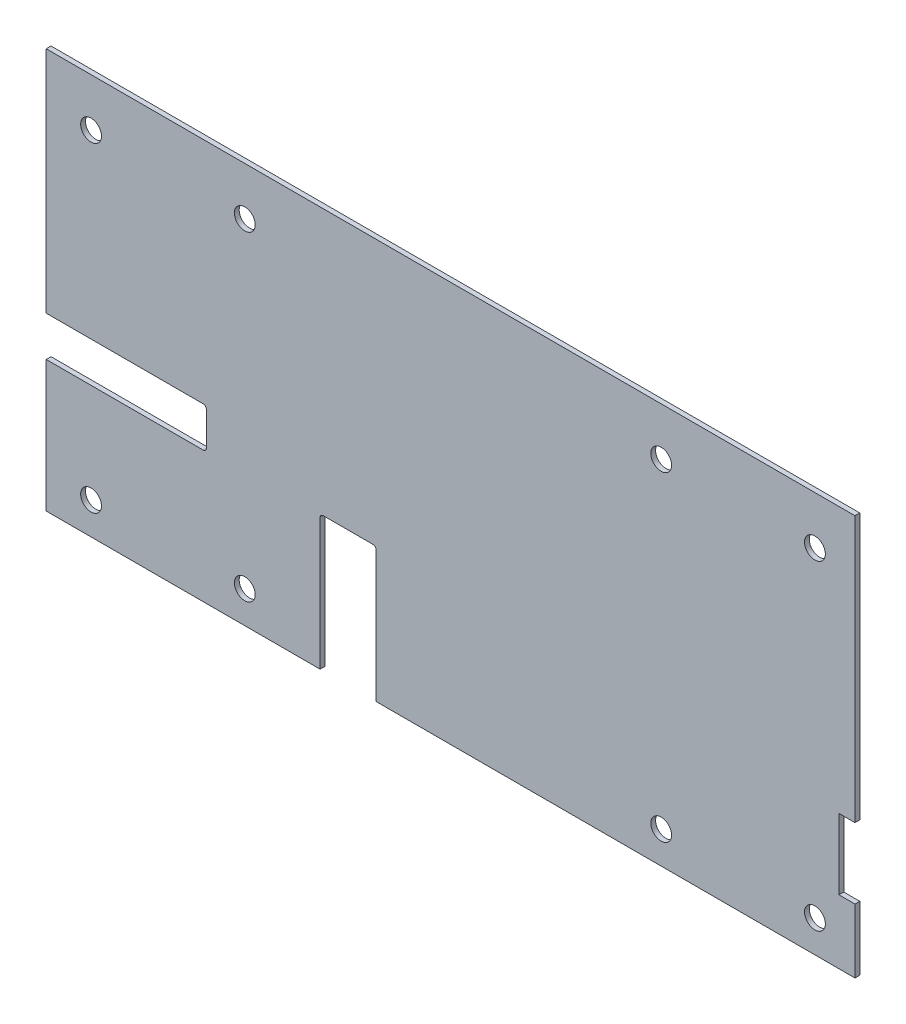
ISO-10303-21;
HEADER;
FILE_DESCRIPTION(('STEP AP214'),'2;1');
FILE_NAME('part.step','',(''),(''),'','','');
FILE_SCHEMA(('AUTOMOTIVE_DESIGN { 1 0 10303 214 1 1 1 1 }'));
ENDSEC;
DATA;
#1=APPLICATION_CONTEXT('core data for automotive mechanical design processes');
#2=APPLICATION_PROTOCOL_DEFINITION('international standard','automotive_design',2000,#1);
#3=PRODUCT_CONTEXT('',#1,'mechanical');
#4=PRODUCT('Part','Part','',(#3));
#5=PRODUCT_RELATED_PRODUCT_CATEGORY('part','',(#4));
#6=PRODUCT_DEFINITION_FORMATION('','',#4);
#7=PRODUCT_DEFINITION_CONTEXT('part definition',#1,'design');
#8=PRODUCT_DEFINITION('design','',#6,#7);
#9=PRODUCT_DEFINITION_SHAPE('','',#8);
#10=(LENGTH_UNIT() NAMED_UNIT(*) SI_UNIT(.MILLI.,.METRE.));
#11=(NAMED_UNIT(*) PLANE_ANGLE_UNIT() SI_UNIT($,.RADIAN.));
#12=(NAMED_UNIT(*) SI_UNIT($,.STERADIAN.) SOLID_ANGLE_UNIT());
#13=UNCERTAINTY_MEASURE_WITH_UNIT(LENGTH_MEASURE(1.E-05),#10,'distance_accuracy_value','');
#14=(GEOMETRIC_REPRESENTATION_CONTEXT(3) GLOBAL_UNCERTAINTY_ASSIGNED_CONTEXT((#13)) GLOBAL_UNIT_ASSIGNED_CONTEXT((#10,
#11,#12)) REPRESENTATION_CONTEXT('',''));
#15=CARTESIAN_POINT('',(0.,0.,0.));
#16=DIRECTION('',(0.,0.,1.));
#17=DIRECTION('',(1.,0.,0.));
#18=AXIS2_PLACEMENT_3D('',#15,#16,#17);
#19=CARTESIAN_POINT('',(-252.5,-125.,3.));
#20=DIRECTION('',(1.,0.,0.));
#21=DIRECTION('',(0.,0.,-1.));
#22=AXIS2_PLACEMENT_3D('',#19,#20,#21);
#23=PLANE('',#22);
#24=DIRECTION('',(0.,-1.,0.));
#25=VECTOR('',#24,1.);
#26=CARTESIAN_POINT('',(-252.5,-125.,0.));
#27=LINE('',#26,#25);
#28=CARTESIAN_POINT('',(-252.5,125.,0.));
#29=VERTEX_POINT('',#28);
#30=CARTESIAN_POINT('',(-252.5,-17.99999999999,0.));
#31=VERTEX_POINT('',#30);
#32=EDGE_CURVE('E218',#29,#31,#27,.T.);
#33=ORIENTED_EDGE('',*,*,#32,.T.);
#34=DIRECTION('',(0.,0.,1.));
#35=VECTOR('',#34,1.);
#36=CARTESIAN_POINT('',(-252.5,-17.99999999999,3.));
#37=LINE('',#36,#35);
#38=CARTESIAN_POINT('',(-252.5,-17.99999999999,3.));
#39=VERTEX_POINT('',#38);
#40=EDGE_CURVE('E179',#31,#39,#37,.T.);
#41=ORIENTED_EDGE('',*,*,#40,.T.);
#42=DIRECTION('',(0.,-1.,0.));
#43=VECTOR('',#42,1.);
#44=CARTESIAN_POINT('',(-252.5,-125.,3.));
#45=LINE('',#44,#43);
#46=CARTESIAN_POINT('',(-252.5,125.,3.));
#47=VERTEX_POINT('',#46);
#48=EDGE_CURVE('E198',#47,#39,#45,.T.);
#49=ORIENTED_EDGE('',*,*,#48,.F.);
#50=DIRECTION('',(0.,0.,-1.));
#51=VECTOR('',#50,1.);
#52=CARTESIAN_POINT('',(-252.5,125.,3.));
#53=LINE('',#52,#51);
#54=EDGE_CURVE('E217',#47,#29,#53,.T.);
#55=ORIENTED_EDGE('',*,*,#54,.T.);
#56=EDGE_LOOP('',(#33,#41,#49,#55));
#57=FACE_BOUND('',#56,.T.);
#58=ADVANCED_FACE('F33',(#57),#23,.F.);
#59=CARTESIAN_POINT('',(252.5,-125.,3.));
#60=DIRECTION('',(0.,1.,0.));
#61=DIRECTION('',(-1.,0.,0.));
#62=AXIS2_PLACEMENT_3D('',#59,#60,#61);
#63=PLANE('',#62);
#64=DIRECTION('',(1.,0.,0.));
#65=VECTOR('',#64,1.);
#66=CARTESIAN_POINT('',(252.5,-125.,3.));
#67=LINE('',#66,#65);
#68=CARTESIAN_POINT('',(-46.5,-125.,3.));
#69=VERTEX_POINT('',#68);
#70=CARTESIAN_POINT('',(252.5,-125.,3.));
#71=VERTEX_POINT('',#70);
#72=EDGE_CURVE('E202',#69,#71,#67,.T.);
#73=ORIENTED_EDGE('',*,*,#72,.F.);
#74=DIRECTION('',(0.,0.,-1.));
#75=VECTOR('',#74,1.);
#76=CARTESIAN_POINT('',(-46.5,-125.,3.));
#77=LINE('',#76,#75);
#78=CARTESIAN_POINT('',(-46.5,-125.,0.));
#79=VERTEX_POINT('',#78);
#80=EDGE_CURVE('E180',#69,#79,#77,.T.);
#81=ORIENTED_EDGE('',*,*,#80,.T.);
#82=DIRECTION('',(1.,0.,0.));
#83=VECTOR('',#82,1.);
#84=CARTESIAN_POINT('',(252.5,-125.,0.));
#85=LINE('',#84,#83);
#86=CARTESIAN_POINT('',(252.5,-125.,0.));
#87=VERTEX_POINT('',#86);
#88=EDGE_CURVE('E221',#79,#87,#85,.T.);
#89=ORIENTED_EDGE('',*,*,#88,.T.);
#90=DIRECTION('',(0.,0.,-1.));
#91=VECTOR('',#90,1.);
#92=CARTESIAN_POINT('',(252.5,-125.,3.));
#93=LINE('',#92,#91);
#94=EDGE_CURVE('E234',#71,#87,#93,.T.);
#95=ORIENTED_EDGE('',*,*,#94,.F.);
#96=EDGE_LOOP('',(#73,#81,#89,#95));
#97=FACE_BOUND('',#96,.T.);
#98=ADVANCED_FACE('F373',(#97),#63,.F.);
#99=CARTESIAN_POINT('',(252.5,-125.,3.));
#100=DIRECTION('',(-1.,0.,0.));
#101=DIRECTION('',(0.,0.,1.));
#102=AXIS2_PLACEMENT_3D('',#99,#100,#101);
#103=PLANE('',#102);
#104=DIRECTION('',(0.,1.,0.));
#105=VECTOR('',#104,1.);
#106=CARTESIAN_POINT('',(252.5,-125.,0.));
#107=LINE('',#106,#105);
#108=CARTESIAN_POINT('',(252.5,-84.9999999999899,0.));
#109=VERTEX_POINT('',#108);
#110=EDGE_CURVE('E203',#87,#109,#107,.T.);
#111=ORIENTED_EDGE('',*,*,#110,.T.);
#112=DIRECTION('',(0.,0.,1.));
#113=VECTOR('',#112,1.);
#114=CARTESIAN_POINT('',(252.5,-84.9999999999899,3.));
#115=LINE('',#114,#113);
#116=CARTESIAN_POINT('',(252.5,-84.9999999999899,3.));
#117=VERTEX_POINT('',#116);
#118=EDGE_CURVE('E241',#109,#117,#115,.T.);
#119=ORIENTED_EDGE('',*,*,#118,.T.);
#120=DIRECTION('',(0.,1.,0.));
#121=VECTOR('',#120,1.);
#122=CARTESIAN_POINT('',(252.5,-125.,3.));
#123=LINE('',#122,#121);
#124=EDGE_CURVE('E212',#71,#117,#123,.T.);
#125=ORIENTED_EDGE('',*,*,#124,.F.);
#126=ORIENTED_EDGE('',*,*,#94,.T.);
#127=EDGE_LOOP('',(#111,#119,#125,#126));
#128=FACE_BOUND('',#127,.T.);
#129=ADVANCED_FACE('F379',(#128),#103,.F.);
#130=CARTESIAN_POINT('',(0.,0.,3.));
#131=DIRECTION('',(0.,0.,1.));
#132=DIRECTION('',(1.,0.,0.));
#133=AXIS2_PLACEMENT_3D('',#130,#131,#132);
#134=PLANE('',#133);
#135=DIRECTION('',(-1.,0.,0.));
#136=VECTOR('',#135,1.);
#137=CARTESIAN_POINT('',(-252.5,-17.99999999999,3.));
#138=LINE('',#137,#136);
#139=CARTESIAN_POINT('',(-154.5,-17.99999999999,3.));
#140=VERTEX_POINT('',#139);
#141=EDGE_CURVE('E289',#140,#39,#138,.T.);
#142=ORIENTED_EDGE('',*,*,#141,.F.);
#143=CARTESIAN_POINT('',(-154.5,-19.99999999999,3.));
#144=DIRECTION('',(0.,0.,1.));
#145=DIRECTION('',(1.,0.,0.));
#146=AXIS2_PLACEMENT_3D('',#143,#144,#145);
#147=CIRCLE('',#146,2.);
#148=CARTESIAN_POINT('',(-152.5,-19.99999999999,3.));
#149=VERTEX_POINT('',#148);
#150=EDGE_CURVE('E41',#140,#149,#147,.F.);
#151=ORIENTED_EDGE('',*,*,#150,.T.);
#152=DIRECTION('',(0.,1.,0.));
#153=VECTOR('',#152,1.);
#154=CARTESIAN_POINT('',(-152.5,-42.99999999999,3.));
#155=LINE('',#154,#153);
#156=CARTESIAN_POINT('',(-152.5,-40.99999999999,3.));
#157=VERTEX_POINT('',#156);
#158=EDGE_CURVE('E191',#157,#149,#155,.T.);
#159=ORIENTED_EDGE('',*,*,#158,.F.);
#160=CARTESIAN_POINT('',(-154.5,-40.99999999999,3.));
#161=DIRECTION('',(0.,0.,1.));
#162=DIRECTION('',(1.,0.,0.));
#163=AXIS2_PLACEMENT_3D('',#160,#161,#162);
#164=CIRCLE('',#163,2.);
#165=CARTESIAN_POINT('',(-154.5,-42.99999999999,3.));
#166=VERTEX_POINT('',#165);
#167=EDGE_CURVE('E190',#157,#166,#164,.F.);
#168=ORIENTED_EDGE('',*,*,#167,.T.);
#169=DIRECTION('',(1.,0.,0.));
#170=VECTOR('',#169,1.);
#171=CARTESIAN_POINT('',(-252.5,-42.99999999999,3.));
#172=LINE('',#171,#170);
#173=CARTESIAN_POINT('',(-252.5,-42.99999999999,3.));
#174=VERTEX_POINT('',#173);
#175=EDGE_CURVE('E172',#174,#166,#172,.T.);
#176=ORIENTED_EDGE('',*,*,#175,.F.);
#177=CARTESIAN_POINT('',(-252.5,-125.,3.));
#178=VERTEX_POINT('',#177);
#179=EDGE_CURVE('E187',#174,#178,#45,.T.);
#180=ORIENTED_EDGE('',*,*,#179,.T.);
#181=CARTESIAN_POINT('',(-81.5000000000001,-125.,3.));
#182=VERTEX_POINT('',#181);
#183=EDGE_CURVE('E209',#178,#182,#67,.T.);
#184=ORIENTED_EDGE('',*,*,#183,.T.);
#185=DIRECTION('',(0.,-1.,0.));
#186=VECTOR('',#185,1.);
#187=CARTESIAN_POINT('',(-81.5,-40.99999999999,3.));
#188=LINE('',#187,#186);
#189=CARTESIAN_POINT('',(-81.5,-42.99999999999,3.));
#190=VERTEX_POINT('',#189);
#191=EDGE_CURVE('E192',#190,#182,#188,.T.);
#192=ORIENTED_EDGE('',*,*,#191,.F.);
#193=CARTESIAN_POINT('',(-79.5,-42.99999999999,3.));
#194=DIRECTION('',(0.,0.,1.));
#195=DIRECTION('',(1.,0.,0.));
#196=AXIS2_PLACEMENT_3D('',#193,#194,#195);
#197=CIRCLE('',#196,2.);
#198=CARTESIAN_POINT('',(-79.5,-40.99999999999,3.));
#199=VERTEX_POINT('',#198);
#200=EDGE_CURVE('E282',#190,#199,#197,.F.);
#201=ORIENTED_EDGE('',*,*,#200,.T.);
#202=DIRECTION('',(-1.,0.,0.));
#203=VECTOR('',#202,1.);
#204=CARTESIAN_POINT('',(-46.5,-40.99999999999,3.));
#205=LINE('',#204,#203);
#206=CARTESIAN_POINT('',(-48.5,-40.99999999999,3.));
#207=VERTEX_POINT('',#206);
#208=EDGE_CURVE('E431',#207,#199,#205,.T.);
#209=ORIENTED_EDGE('',*,*,#208,.F.);
#210=CARTESIAN_POINT('',(-48.5,-42.99999999999,3.));
#211=DIRECTION('',(0.,0.,1.));
#212=DIRECTION('',(1.,0.,0.));
#213=AXIS2_PLACEMENT_3D('',#210,#211,#212);
#214=CIRCLE('',#213,2.);
#215=CARTESIAN_POINT('',(-46.5,-42.99999999999,3.));
#216=VERTEX_POINT('',#215);
#217=EDGE_CURVE('E278',#207,#216,#214,.F.);
#218=ORIENTED_EDGE('',*,*,#217,.T.);
#219=DIRECTION('',(0.,1.,0.));
#220=VECTOR('',#219,1.);
#221=CARTESIAN_POINT('',(-46.5,-40.99999999999,3.));
#222=LINE('',#221,#220);
#223=EDGE_CURVE('E436',#69,#216,#222,.T.);
#224=ORIENTED_EDGE('',*,*,#223,.F.);
#225=ORIENTED_EDGE('',*,*,#72,.T.);
#226=ORIENTED_EDGE('',*,*,#124,.T.);
#227=DIRECTION('',(1.,0.,0.));
#228=VECTOR('',#227,1.);
#229=CARTESIAN_POINT('',(252.5,-84.9999999999899,3.));
#230=LINE('',#229,#228);
#231=CARTESIAN_POINT('',(242.5,-84.9999999999899,3.));
#232=VERTEX_POINT('',#231);
#233=EDGE_CURVE('E449',#232,#117,#230,.T.);
#234=ORIENTED_EDGE('',*,*,#233,.F.);
#235=DIRECTION('',(0.,-1.,0.));
#236=VECTOR('',#235,1.);
#237=CARTESIAN_POINT('',(242.5,-40.9999999999899,3.));
#238=LINE('',#237,#236);
#239=CARTESIAN_POINT('',(242.5,-40.9999999999899,3.));
#240=VERTEX_POINT('',#239);
#241=EDGE_CURVE('E446',#240,#232,#238,.T.);
#242=ORIENTED_EDGE('',*,*,#241,.F.);
#243=DIRECTION('',(-1.,0.,0.));
#244=VECTOR('',#243,1.);
#245=CARTESIAN_POINT('',(252.5,-40.9999999999899,3.));
#246=LINE('',#245,#244);
#247=CARTESIAN_POINT('',(252.5,-40.9999999999899,3.));
#248=VERTEX_POINT('',#247);
#249=EDGE_CURVE('E443',#248,#240,#246,.T.);
#250=ORIENTED_EDGE('',*,*,#249,.F.);
#251=CARTESIAN_POINT('',(252.5,125.,3.));
#252=VERTEX_POINT('',#251);
#253=EDGE_CURVE('E211',#248,#252,#123,.T.);
#254=ORIENTED_EDGE('',*,*,#253,.T.);
#255=DIRECTION('',(-1.,0.,0.));
#256=VECTOR('',#255,1.);
#257=CARTESIAN_POINT('',(252.5,125.,3.));
#258=LINE('',#257,#256);
#259=EDGE_CURVE('E215',#252,#47,#258,.T.);
#260=ORIENTED_EDGE('',*,*,#259,.T.);
#261=ORIENTED_EDGE('',*,*,#48,.T.);
#262=EDGE_LOOP('',(#142,#151,#159,#168,#176,#180,#184,#192,#201,#209,#218,#224,#225,#226,#234,
#242,#250,#254,#260,#261));
#263=FACE_BOUND('',#262,.T.);
#264=CARTESIAN_POINT('',(-224.5,95.0000000000001,3.));
#265=DIRECTION('',(0.,0.,1.));
#266=DIRECTION('',(1.,0.,0.));
#267=AXIS2_PLACEMENT_3D('',#264,#265,#266);
#268=CIRCLE('',#267,6.50000000000002);
#269=CARTESIAN_POINT('',(-218.,95.0000000000001,3.));
#270=VERTEX_POINT('',#269);
#271=EDGE_CURVE('E312',#270,#270,#268,.T.);
#272=ORIENTED_EDGE('',*,*,#271,.F.);
#273=EDGE_LOOP('',(#272));
#274=FACE_BOUND('',#273,.T.);
#275=CARTESIAN_POINT('',(-128.5,-105.,3.));
#276=DIRECTION('',(0.,0.,1.));
#277=DIRECTION('',(1.,0.,0.));
#278=AXIS2_PLACEMENT_3D('',#275,#276,#277);
#279=CIRCLE('',#278,6.50000000000002);
#280=CARTESIAN_POINT('',(-122.,-105.,3.));
#281=VERTEX_POINT('',#280);
#282=EDGE_CURVE('E324',#281,#281,#279,.T.);
#283=ORIENTED_EDGE('',*,*,#282,.F.);
#284=EDGE_LOOP('',(#283));
#285=FACE_BOUND('',#284,.T.);
#286=CARTESIAN_POINT('',(131.5,-105.,3.));
#287=DIRECTION('',(0.,0.,1.));
#288=DIRECTION('',(1.,0.,0.));
#289=AXIS2_PLACEMENT_3D('',#286,#287,#288);
#290=CIRCLE('',#289,6.50000000000002);
#291=CARTESIAN_POINT('',(138.,-105.,3.));
#292=VERTEX_POINT('',#291);
#293=EDGE_CURVE('E336',#292,#292,#290,.T.);
#294=ORIENTED_EDGE('',*,*,#293,.F.);
#295=EDGE_LOOP('',(#294));
#296=FACE_BOUND('',#295,.T.);
#297=CARTESIAN_POINT('',(131.5,95.0000000000001,3.));
#298=DIRECTION('',(0.,0.,1.));
#299=DIRECTION('',(1.,0.,0.));
#300=AXIS2_PLACEMENT_3D('',#297,#298,#299);
#301=CIRCLE('',#300,6.50000000000002);
#302=CARTESIAN_POINT('',(138.,95.0000000000001,3.));
#303=VERTEX_POINT('',#302);
#304=EDGE_CURVE('E346',#303,#303,#301,.T.);
#305=ORIENTED_EDGE('',*,*,#304,.F.);
#306=EDGE_LOOP('',(#305));
#307=FACE_BOUND('',#306,.T.);
#308=CARTESIAN_POINT('',(227.5,95.0000000000001,3.));
#309=DIRECTION('',(0.,0.,1.));
#310=DIRECTION('',(1.,0.,0.));
#311=AXIS2_PLACEMENT_3D('',#308,#309,#310);
#312=CIRCLE('',#311,6.50000000000002);
#313=CARTESIAN_POINT('',(234.,95.0000000000001,3.));
#314=VERTEX_POINT('',#313);
#315=EDGE_CURVE('E342',#314,#314,#312,.T.);
#316=ORIENTED_EDGE('',*,*,#315,.F.);
#317=EDGE_LOOP('',(#316));
#318=FACE_BOUND('',#317,.T.);
#319=CARTESIAN_POINT('',(227.5,-105.,3.));
#320=DIRECTION('',(0.,0.,1.));
#321=DIRECTION('',(1.,0.,0.));
#322=AXIS2_PLACEMENT_3D('',#319,#320,#321);
#323=CIRCLE('',#322,6.50000000000007);
#324=CARTESIAN_POINT('',(234.,-105.,3.));
#325=VERTEX_POINT('',#324);
#326=EDGE_CURVE('E330',#325,#325,#323,.T.);
#327=ORIENTED_EDGE('',*,*,#326,.F.);
#328=EDGE_LOOP('',(#327));
#329=FACE_BOUND('',#328,.T.);
#330=CARTESIAN_POINT('',(-128.5,95.0000000000001,3.));
#331=DIRECTION('',(0.,0.,1.));
#332=DIRECTION('',(1.,0.,0.));
#333=AXIS2_PLACEMENT_3D('',#330,#331,#332);
#334=CIRCLE('',#333,6.50000000000002);
#335=CARTESIAN_POINT('',(-122.,95.0000000000001,3.));
#336=VERTEX_POINT('',#335);
#337=EDGE_CURVE('E318',#336,#336,#334,.T.);
#338=ORIENTED_EDGE('',*,*,#337,.F.);
#339=EDGE_LOOP('',(#338));
#340=FACE_BOUND('',#339,.T.);
#341=CARTESIAN_POINT('',(-224.5,-105.,3.));
#342=DIRECTION('',(0.,0.,1.));
#343=DIRECTION('',(1.,0.,0.));
#344=AXIS2_PLACEMENT_3D('',#341,#342,#343);
#345=CIRCLE('',#344,6.50000000000002);
#346=CARTESIAN_POINT('',(-218.,-105.,3.));
#347=VERTEX_POINT('',#346);
#348=EDGE_CURVE('E303',#347,#347,#345,.T.);
#349=ORIENTED_EDGE('',*,*,#348,.F.);
#350=EDGE_LOOP('',(#349));
#351=FACE_BOUND('',#350,.T.);
#352=ADVANCED_FACE('F184',(#263,#274,#285,#296,#307,#318,#329,#340,#351),#134,.T.);
#353=CARTESIAN_POINT('',(0.,0.,0.));
#354=DIRECTION('',(0.,0.,1.));
#355=DIRECTION('',(1.,0.,0.));
#356=AXIS2_PLACEMENT_3D('',#353,#354,#355);
#357=PLANE('',#356);
#358=DIRECTION('',(1.,0.,0.));
#359=VECTOR('',#358,1.);
#360=CARTESIAN_POINT('',(0.,-42.99999999999,0.));
#361=LINE('',#360,#359);
#362=CARTESIAN_POINT('',(-252.5,-42.99999999999,0.));
#363=VERTEX_POINT('',#362);
#364=CARTESIAN_POINT('',(-154.5,-42.99999999999,0.));
#365=VERTEX_POINT('',#364);
#366=EDGE_CURVE('E175',#363,#365,#361,.T.);
#367=ORIENTED_EDGE('',*,*,#366,.T.);
#368=CARTESIAN_POINT('',(-154.5,-40.99999999999,0.));
#369=DIRECTION('',(0.,0.,1.));
#370=DIRECTION('',(1.,0.,0.));
#371=AXIS2_PLACEMENT_3D('',#368,#369,#370);
#372=CIRCLE('',#371,2.);
#373=CARTESIAN_POINT('',(-152.5,-40.99999999999,0.));
#374=VERTEX_POINT('',#373);
#375=EDGE_CURVE('E287',#365,#374,#372,.T.);
#376=ORIENTED_EDGE('',*,*,#375,.T.);
#377=DIRECTION('',(0.,1.,0.));
#378=VECTOR('',#377,1.);
#379=CARTESIAN_POINT('',(-152.5,0.,0.));
#380=LINE('',#379,#378);
#381=CARTESIAN_POINT('',(-152.5,-19.99999999999,0.));
#382=VERTEX_POINT('',#381);
#383=EDGE_CURVE('E257',#374,#382,#380,.T.);
#384=ORIENTED_EDGE('',*,*,#383,.T.);
#385=CARTESIAN_POINT('',(-154.5,-19.99999999999,0.));
#386=DIRECTION('',(0.,0.,1.));
#387=DIRECTION('',(1.,0.,0.));
#388=AXIS2_PLACEMENT_3D('',#385,#386,#387);
#389=CIRCLE('',#388,2.);
#390=CARTESIAN_POINT('',(-154.5,-17.99999999999,0.));
#391=VERTEX_POINT('',#390);
#392=EDGE_CURVE('E11',#382,#391,#389,.T.);
#393=ORIENTED_EDGE('',*,*,#392,.T.);
#394=DIRECTION('',(-1.,0.,0.));
#395=VECTOR('',#394,1.);
#396=CARTESIAN_POINT('',(0.,-17.99999999999,0.));
#397=LINE('',#396,#395);
#398=EDGE_CURVE('E298',#391,#31,#397,.T.);
#399=ORIENTED_EDGE('',*,*,#398,.T.);
#400=ORIENTED_EDGE('',*,*,#32,.F.);
#401=DIRECTION('',(-1.,0.,0.));
#402=VECTOR('',#401,1.);
#403=CARTESIAN_POINT('',(252.5,125.,0.));
#404=LINE('',#403,#402);
#405=CARTESIAN_POINT('',(252.5,125.,0.));
#406=VERTEX_POINT('',#405);
#407=EDGE_CURVE('E199',#406,#29,#404,.T.);
#408=ORIENTED_EDGE('',*,*,#407,.F.);
#409=CARTESIAN_POINT('',(252.5,-40.9999999999899,0.));
#410=VERTEX_POINT('',#409);
#411=EDGE_CURVE('E226',#410,#406,#107,.T.);
#412=ORIENTED_EDGE('',*,*,#411,.F.);
#413=DIRECTION('',(-1.,0.,0.));
#414=VECTOR('',#413,1.);
#415=CARTESIAN_POINT('',(0.,-40.9999999999896,0.));
#416=LINE('',#415,#414);
#417=CARTESIAN_POINT('',(242.5,-40.9999999999899,0.));
#418=VERTEX_POINT('',#417);
#419=EDGE_CURVE('E415',#410,#418,#416,.T.);
#420=ORIENTED_EDGE('',*,*,#419,.T.);
#421=DIRECTION('',(0.,-1.,0.));
#422=VECTOR('',#421,1.);
#423=CARTESIAN_POINT('',(242.5,0.,0.));
#424=LINE('',#423,#422);
#425=CARTESIAN_POINT('',(242.5,-84.9999999999899,0.));
#426=VERTEX_POINT('',#425);
#427=EDGE_CURVE('E251',#418,#426,#424,.T.);
#428=ORIENTED_EDGE('',*,*,#427,.T.);
#429=DIRECTION('',(1.,0.,0.));
#430=VECTOR('',#429,1.);
#431=CARTESIAN_POINT('',(-1.17961196366408E-13,-84.9999999999896,0.));
#432=LINE('',#431,#430);
#433=EDGE_CURVE('E410',#426,#109,#432,.T.);
#434=ORIENTED_EDGE('',*,*,#433,.T.);
#435=ORIENTED_EDGE('',*,*,#110,.F.);
#436=ORIENTED_EDGE('',*,*,#88,.F.);
#437=DIRECTION('',(0.,1.,0.));
#438=VECTOR('',#437,1.);
#439=CARTESIAN_POINT('',(-46.5,0.,0.));
#440=LINE('',#439,#438);
#441=CARTESIAN_POINT('',(-46.5,-42.99999999999,0.));
#442=VERTEX_POINT('',#441);
#443=EDGE_CURVE('E305',#79,#442,#440,.T.);
#444=ORIENTED_EDGE('',*,*,#443,.T.);
#445=CARTESIAN_POINT('',(-48.5,-42.99999999999,0.));
#446=DIRECTION('',(0.,0.,1.));
#447=DIRECTION('',(1.,0.,0.));
#448=AXIS2_PLACEMENT_3D('',#445,#446,#447);
#449=CIRCLE('',#448,2.);
#450=CARTESIAN_POINT('',(-48.5,-40.99999999999,0.));
#451=VERTEX_POINT('',#450);
#452=EDGE_CURVE('E280',#442,#451,#449,.T.);
#453=ORIENTED_EDGE('',*,*,#452,.T.);
#454=DIRECTION('',(-1.,0.,0.));
#455=VECTOR('',#454,1.);
#456=CARTESIAN_POINT('',(0.,-40.99999999999,0.));
#457=LINE('',#456,#455);
#458=CARTESIAN_POINT('',(-79.5,-40.99999999999,0.));
#459=VERTEX_POINT('',#458);
#460=EDGE_CURVE('E254',#451,#459,#457,.T.);
#461=ORIENTED_EDGE('',*,*,#460,.T.);
#462=CARTESIAN_POINT('',(-79.5,-42.99999999999,0.));
#463=DIRECTION('',(0.,0.,1.));
#464=DIRECTION('',(1.,0.,0.));
#465=AXIS2_PLACEMENT_3D('',#462,#463,#464);
#466=CIRCLE('',#465,2.);
#467=CARTESIAN_POINT('',(-81.5,-42.99999999999,0.));
#468=VERTEX_POINT('',#467);
#469=EDGE_CURVE('E284',#459,#468,#466,.T.);
#470=ORIENTED_EDGE('',*,*,#469,.T.);
#471=DIRECTION('',(0.,-1.,0.));
#472=VECTOR('',#471,1.);
#473=CARTESIAN_POINT('',(-81.5,0.,0.));
#474=LINE('',#473,#472);
#475=CARTESIAN_POINT('',(-81.5,-125.,0.));
#476=VERTEX_POINT('',#475);
#477=EDGE_CURVE('E414',#468,#476,#474,.T.);
#478=ORIENTED_EDGE('',*,*,#477,.T.);
#479=CARTESIAN_POINT('',(-252.5,-125.,0.));
#480=VERTEX_POINT('',#479);
#481=EDGE_CURVE('E223',#480,#476,#85,.T.);
#482=ORIENTED_EDGE('',*,*,#481,.F.);
#483=EDGE_CURVE('E222',#363,#480,#27,.T.);
#484=ORIENTED_EDGE('',*,*,#483,.F.);
#485=EDGE_LOOP('',(#367,#376,#384,#393,#399,#400,#408,#412,#420,#428,#434,#435,#436,#444,#453,
#461,#470,#478,#482,#484));
#486=FACE_BOUND('',#485,.T.);
#487=CARTESIAN_POINT('',(131.5,95.0000000000001,0.));
#488=DIRECTION('',(0.,0.,1.));
#489=DIRECTION('',(1.,0.,0.));
#490=AXIS2_PLACEMENT_3D('',#487,#488,#489);
#491=CIRCLE('',#490,6.50000000000002);
#492=CARTESIAN_POINT('',(138.,95.0000000000001,0.));
#493=VERTEX_POINT('',#492);
#494=EDGE_CURVE('E207',#493,#493,#491,.T.);
#495=ORIENTED_EDGE('',*,*,#494,.T.);
#496=EDGE_LOOP('',(#495));
#497=FACE_BOUND('',#496,.T.);
#498=CARTESIAN_POINT('',(227.5,95.0000000000001,0.));
#499=DIRECTION('',(0.,0.,1.));
#500=DIRECTION('',(1.,0.,0.));
#501=AXIS2_PLACEMENT_3D('',#498,#499,#500);
#502=CIRCLE('',#501,6.50000000000002);
#503=CARTESIAN_POINT('',(234.,95.0000000000001,0.));
#504=VERTEX_POINT('',#503);
#505=EDGE_CURVE('E339',#504,#504,#502,.T.);
#506=ORIENTED_EDGE('',*,*,#505,.T.);
#507=EDGE_LOOP('',(#506));
#508=FACE_BOUND('',#507,.T.);
#509=CARTESIAN_POINT('',(131.5,-105.,0.));
#510=DIRECTION('',(0.,0.,1.));
#511=DIRECTION('',(1.,0.,0.));
#512=AXIS2_PLACEMENT_3D('',#509,#510,#511);
#513=CIRCLE('',#512,6.50000000000002);
#514=CARTESIAN_POINT('',(138.,-105.,0.));
#515=VERTEX_POINT('',#514);
#516=EDGE_CURVE('E333',#515,#515,#513,.T.);
#517=ORIENTED_EDGE('',*,*,#516,.T.);
#518=EDGE_LOOP('',(#517));
#519=FACE_BOUND('',#518,.T.);
#520=CARTESIAN_POINT('',(227.5,-105.,0.));
#521=DIRECTION('',(0.,0.,1.));
#522=DIRECTION('',(1.,0.,0.));
#523=AXIS2_PLACEMENT_3D('',#520,#521,#522);
#524=CIRCLE('',#523,6.50000000000007);
#525=CARTESIAN_POINT('',(234.,-105.,0.));
#526=VERTEX_POINT('',#525);
#527=EDGE_CURVE('E327',#526,#526,#524,.T.);
#528=ORIENTED_EDGE('',*,*,#527,.T.);
#529=EDGE_LOOP('',(#528));
#530=FACE_BOUND('',#529,.T.);
#531=CARTESIAN_POINT('',(-128.5,-105.,0.));
#532=DIRECTION('',(0.,0.,1.));
#533=DIRECTION('',(1.,0.,0.));
#534=AXIS2_PLACEMENT_3D('',#531,#532,#533);
#535=CIRCLE('',#534,6.50000000000002);
#536=CARTESIAN_POINT('',(-122.,-105.,0.));
#537=VERTEX_POINT('',#536);
#538=EDGE_CURVE('E321',#537,#537,#535,.T.);
#539=ORIENTED_EDGE('',*,*,#538,.T.);
#540=EDGE_LOOP('',(#539));
#541=FACE_BOUND('',#540,.T.);
#542=CARTESIAN_POINT('',(-128.5,95.0000000000001,0.));
#543=DIRECTION('',(0.,0.,1.));
#544=DIRECTION('',(1.,0.,0.));
#545=AXIS2_PLACEMENT_3D('',#542,#543,#544);
#546=CIRCLE('',#545,6.50000000000002);
#547=CARTESIAN_POINT('',(-122.,95.0000000000001,0.));
#548=VERTEX_POINT('',#547);
#549=EDGE_CURVE('E315',#548,#548,#546,.T.);
#550=ORIENTED_EDGE('',*,*,#549,.T.);
#551=EDGE_LOOP('',(#550));
#552=FACE_BOUND('',#551,.T.);
#553=CARTESIAN_POINT('',(-224.5,95.0000000000001,0.));
#554=DIRECTION('',(0.,0.,1.));
#555=DIRECTION('',(1.,0.,0.));
#556=AXIS2_PLACEMENT_3D('',#553,#554,#555);
#557=CIRCLE('',#556,6.50000000000002);
#558=CARTESIAN_POINT('',(-218.,95.0000000000001,0.));
#559=VERTEX_POINT('',#558);
#560=EDGE_CURVE('E310',#559,#559,#557,.T.);
#561=ORIENTED_EDGE('',*,*,#560,.T.);
#562=EDGE_LOOP('',(#561));
#563=FACE_BOUND('',#562,.T.);
#564=CARTESIAN_POINT('',(-224.5,-105.,0.));
#565=DIRECTION('',(0.,0.,1.));
#566=DIRECTION('',(1.,0.,0.));
#567=AXIS2_PLACEMENT_3D('',#564,#565,#566);
#568=CIRCLE('',#567,6.50000000000002);
#569=CARTESIAN_POINT('',(-218.,-105.,0.));
#570=VERTEX_POINT('',#569);
#571=EDGE_CURVE('E300',#570,#570,#568,.T.);
#572=ORIENTED_EDGE('',*,*,#571,.T.);
#573=EDGE_LOOP('',(#572));
#574=FACE_BOUND('',#573,.T.);
#575=ADVANCED_FACE('F353',(#486,#497,#508,#519,#530,#541,#552,#563,#574),#357,.F.);
#576=ORIENTED_EDGE('',*,*,#179,.F.);
#577=DIRECTION('',(0.,0.,-1.));
#578=VECTOR('',#577,1.);
#579=CARTESIAN_POINT('',(-252.5,-42.99999999999,3.));
#580=LINE('',#579,#578);
#581=EDGE_CURVE('E169',#174,#363,#580,.T.);
#582=ORIENTED_EDGE('',*,*,#581,.T.);
#583=ORIENTED_EDGE('',*,*,#483,.T.);
#584=DIRECTION('',(0.,0.,-1.));
#585=VECTOR('',#584,1.);
#586=CARTESIAN_POINT('',(-252.5,-125.,3.));
#587=LINE('',#586,#585);
#588=EDGE_CURVE('E197',#178,#480,#587,.T.);
#589=ORIENTED_EDGE('',*,*,#588,.F.);
#590=EDGE_LOOP('',(#576,#582,#583,#589));
#591=FACE_BOUND('',#590,.T.);
#592=ADVANCED_FACE('F195',(#591),#23,.F.);
#593=ORIENTED_EDGE('',*,*,#481,.T.);
#594=DIRECTION('',(0.,0.,1.));
#595=VECTOR('',#594,1.);
#596=CARTESIAN_POINT('',(-81.5,-125.,3.));
#597=LINE('',#596,#595);
#598=EDGE_CURVE('E244',#476,#182,#597,.T.);
#599=ORIENTED_EDGE('',*,*,#598,.T.);
#600=ORIENTED_EDGE('',*,*,#183,.F.);
#601=ORIENTED_EDGE('',*,*,#588,.T.);
#602=EDGE_LOOP('',(#593,#599,#600,#601));
#603=FACE_BOUND('',#602,.T.);
#604=ADVANCED_FACE('F382',(#603),#63,.F.);
#605=ORIENTED_EDGE('',*,*,#253,.F.);
#606=DIRECTION('',(0.,0.,-1.));
#607=VECTOR('',#606,1.);
#608=CARTESIAN_POINT('',(252.5,-40.9999999999899,3.));
#609=LINE('',#608,#607);
#610=EDGE_CURVE('E238',#248,#410,#609,.T.);
#611=ORIENTED_EDGE('',*,*,#610,.T.);
#612=ORIENTED_EDGE('',*,*,#411,.T.);
#613=DIRECTION('',(0.,0.,-1.));
#614=VECTOR('',#613,1.);
#615=CARTESIAN_POINT('',(252.5,125.,3.));
#616=LINE('',#615,#614);
#617=EDGE_CURVE('E231',#252,#406,#616,.T.);
#618=ORIENTED_EDGE('',*,*,#617,.F.);
#619=EDGE_LOOP('',(#605,#611,#612,#618));
#620=FACE_BOUND('',#619,.T.);
#621=ADVANCED_FACE('F368',(#620),#103,.F.);
#622=CARTESIAN_POINT('',(252.5,125.,3.));
#623=DIRECTION('',(0.,-1.,0.));
#624=DIRECTION('',(1.,0.,0.));
#625=AXIS2_PLACEMENT_3D('',#622,#623,#624);
#626=PLANE('',#625);
#627=ORIENTED_EDGE('',*,*,#407,.T.);
#628=ORIENTED_EDGE('',*,*,#54,.F.);
#629=ORIENTED_EDGE('',*,*,#259,.F.);
#630=ORIENTED_EDGE('',*,*,#617,.T.);
#631=EDGE_LOOP('',(#627,#628,#629,#630));
#632=FACE_BOUND('',#631,.T.);
#633=ADVANCED_FACE('F359',(#632),#626,.F.);
#634=CARTESIAN_POINT('',(131.5,95.0000000000001,3.));
#635=DIRECTION('',(0.,0.,-1.));
#636=DIRECTION('',(-1.,0.,0.));
#637=AXIS2_PLACEMENT_3D('',#634,#635,#636);
#638=CYLINDRICAL_SURFACE('',#637,6.50000000000002);
#639=ORIENTED_EDGE('',*,*,#304,.T.);
#640=EDGE_LOOP('',(#639));
#641=FACE_BOUND('',#640,.T.);
#642=ORIENTED_EDGE('',*,*,#494,.F.);
#643=EDGE_LOOP('',(#642));
#644=FACE_BOUND('',#643,.T.);
#645=ADVANCED_FACE('F356',(#641,#644),#638,.F.);
#646=CARTESIAN_POINT('',(227.5,95.0000000000001,3.));
#647=DIRECTION('',(0.,0.,-1.));
#648=DIRECTION('',(-1.,0.,0.));
#649=AXIS2_PLACEMENT_3D('',#646,#647,#648);
#650=CYLINDRICAL_SURFACE('',#649,6.50000000000002);
#651=ORIENTED_EDGE('',*,*,#315,.T.);
#652=EDGE_LOOP('',(#651));
#653=FACE_BOUND('',#652,.T.);
#654=ORIENTED_EDGE('',*,*,#505,.F.);
#655=EDGE_LOOP('',(#654));
#656=FACE_BOUND('',#655,.T.);
#657=ADVANCED_FACE('F358',(#653,#656),#650,.F.);
#658=CARTESIAN_POINT('',(131.5,-105.,3.));
#659=DIRECTION('',(0.,0.,-1.));
#660=DIRECTION('',(-1.,0.,0.));
#661=AXIS2_PLACEMENT_3D('',#658,#659,#660);
#662=CYLINDRICAL_SURFACE('',#661,6.50000000000002);
#663=ORIENTED_EDGE('',*,*,#293,.T.);
#664=EDGE_LOOP('',(#663));
#665=FACE_BOUND('',#664,.T.);
#666=ORIENTED_EDGE('',*,*,#516,.F.);
#667=EDGE_LOOP('',(#666));
#668=FACE_BOUND('',#667,.T.);
#669=ADVANCED_FACE('F365',(#665,#668),#662,.F.);
#670=CARTESIAN_POINT('',(227.5,-105.,3.));
#671=DIRECTION('',(0.,0.,-1.));
#672=DIRECTION('',(-1.,0.,0.));
#673=AXIS2_PLACEMENT_3D('',#670,#671,#672);
#674=CYLINDRICAL_SURFACE('',#673,6.50000000000007);
#675=ORIENTED_EDGE('',*,*,#326,.T.);
#676=EDGE_LOOP('',(#675));
#677=FACE_BOUND('',#676,.T.);
#678=ORIENTED_EDGE('',*,*,#527,.F.);
#679=EDGE_LOOP('',(#678));
#680=FACE_BOUND('',#679,.T.);
#681=ADVANCED_FACE('F488',(#677,#680),#674,.F.);
#682=CARTESIAN_POINT('',(-128.5,-105.,3.));
#683=DIRECTION('',(0.,0.,-1.));
#684=DIRECTION('',(-1.,0.,0.));
#685=AXIS2_PLACEMENT_3D('',#682,#683,#684);
#686=CYLINDRICAL_SURFACE('',#685,6.50000000000002);
#687=ORIENTED_EDGE('',*,*,#282,.T.);
#688=EDGE_LOOP('',(#687));
#689=FACE_BOUND('',#688,.T.);
#690=ORIENTED_EDGE('',*,*,#538,.F.);
#691=EDGE_LOOP('',(#690));
#692=FACE_BOUND('',#691,.T.);
#693=ADVANCED_FACE('F484',(#689,#692),#686,.F.);
#694=CARTESIAN_POINT('',(-128.5,95.0000000000001,3.));
#695=DIRECTION('',(0.,0.,-1.));
#696=DIRECTION('',(-1.,0.,0.));
#697=AXIS2_PLACEMENT_3D('',#694,#695,#696);
#698=CYLINDRICAL_SURFACE('',#697,6.50000000000002);
#699=ORIENTED_EDGE('',*,*,#337,.T.);
#700=EDGE_LOOP('',(#699));
#701=FACE_BOUND('',#700,.T.);
#702=ORIENTED_EDGE('',*,*,#549,.F.);
#703=EDGE_LOOP('',(#702));
#704=FACE_BOUND('',#703,.T.);
#705=ADVANCED_FACE('F480',(#701,#704),#698,.F.);
#706=CARTESIAN_POINT('',(-224.5,95.0000000000001,3.));
#707=DIRECTION('',(0.,0.,-1.));
#708=DIRECTION('',(-1.,0.,0.));
#709=AXIS2_PLACEMENT_3D('',#706,#707,#708);
#710=CYLINDRICAL_SURFACE('',#709,6.50000000000002);
#711=ORIENTED_EDGE('',*,*,#271,.T.);
#712=EDGE_LOOP('',(#711));
#713=FACE_BOUND('',#712,.T.);
#714=ORIENTED_EDGE('',*,*,#560,.F.);
#715=EDGE_LOOP('',(#714));
#716=FACE_BOUND('',#715,.T.);
#717=ADVANCED_FACE('F476',(#713,#716),#710,.F.);
#718=CARTESIAN_POINT('',(-224.5,-105.,3.));
#719=DIRECTION('',(0.,0.,-1.));
#720=DIRECTION('',(-1.,0.,0.));
#721=AXIS2_PLACEMENT_3D('',#718,#719,#720);
#722=CYLINDRICAL_SURFACE('',#721,6.50000000000002);
#723=ORIENTED_EDGE('',*,*,#348,.T.);
#724=EDGE_LOOP('',(#723));
#725=FACE_BOUND('',#724,.T.);
#726=ORIENTED_EDGE('',*,*,#571,.F.);
#727=EDGE_LOOP('',(#726));
#728=FACE_BOUND('',#727,.T.);
#729=ADVANCED_FACE('F468',(#725,#728),#722,.F.);
#730=CARTESIAN_POINT('',(242.5,-40.9999999999899,-7.));
#731=DIRECTION('',(-1.,0.,0.));
#732=DIRECTION('',(0.,0.,1.));
#733=AXIS2_PLACEMENT_3D('',#730,#731,#732);
#734=PLANE('',#733);
#735=DIRECTION('',(0.,0.,1.));
#736=VECTOR('',#735,1.);
#737=CARTESIAN_POINT('',(242.5,-40.9999999999899,-7.));
#738=LINE('',#737,#736);
#739=EDGE_CURVE('E451',#418,#240,#738,.T.);
#740=ORIENTED_EDGE('',*,*,#739,.T.);
#741=ORIENTED_EDGE('',*,*,#241,.T.);
#742=DIRECTION('',(0.,0.,1.));
#743=VECTOR('',#742,1.);
#744=CARTESIAN_POINT('',(242.5,-84.9999999999899,-7.));
#745=LINE('',#744,#743);
#746=EDGE_CURVE('E439',#426,#232,#745,.T.);
#747=ORIENTED_EDGE('',*,*,#746,.F.);
#748=ORIENTED_EDGE('',*,*,#427,.F.);
#749=EDGE_LOOP('',(#740,#741,#747,#748));
#750=FACE_BOUND('',#749,.T.);
#751=ADVANCED_FACE('F454',(#750),#734,.F.);
#752=CARTESIAN_POINT('',(252.5,-84.9999999999899,-7.));
#753=DIRECTION('',(0.,-1.,0.));
#754=DIRECTION('',(1.,0.,0.));
#755=AXIS2_PLACEMENT_3D('',#752,#753,#754);
#756=PLANE('',#755);
#757=ORIENTED_EDGE('',*,*,#746,.T.);
#758=ORIENTED_EDGE('',*,*,#233,.T.);
#759=ORIENTED_EDGE('',*,*,#118,.F.);
#760=ORIENTED_EDGE('',*,*,#433,.F.);
#761=EDGE_LOOP('',(#757,#758,#759,#760));
#762=FACE_BOUND('',#761,.T.);
#763=ADVANCED_FACE('F460',(#762),#756,.F.);
#764=CARTESIAN_POINT('',(252.5,-40.9999999999899,-7.));
#765=DIRECTION('',(0.,1.,0.));
#766=DIRECTION('',(-1.,0.,0.));
#767=AXIS2_PLACEMENT_3D('',#764,#765,#766);
#768=PLANE('',#767);
#769=ORIENTED_EDGE('',*,*,#610,.F.);
#770=ORIENTED_EDGE('',*,*,#249,.T.);
#771=ORIENTED_EDGE('',*,*,#739,.F.);
#772=ORIENTED_EDGE('',*,*,#419,.F.);
#773=EDGE_LOOP('',(#769,#770,#771,#772));
#774=FACE_BOUND('',#773,.T.);
#775=ADVANCED_FACE('F459',(#774),#768,.F.);
#776=CARTESIAN_POINT('',(-46.5,-40.99999999999,-7.));
#777=DIRECTION('',(0.,1.,0.));
#778=DIRECTION('',(0.,0.,1.));
#779=AXIS2_PLACEMENT_3D('',#776,#777,#778);
#780=PLANE('',#779);
#781=ORIENTED_EDGE('',*,*,#460,.F.);
#782=DIRECTION('',(0.,0.,1.));
#783=VECTOR('',#782,1.);
#784=CARTESIAN_POINT('',(-48.5,-40.99999999999,3.));
#785=LINE('',#784,#783);
#786=EDGE_CURVE('E261',#451,#207,#785,.T.);
#787=ORIENTED_EDGE('',*,*,#786,.T.);
#788=ORIENTED_EDGE('',*,*,#208,.T.);
#789=DIRECTION('',(0.,0.,1.));
#790=VECTOR('',#789,1.);
#791=CARTESIAN_POINT('',(-79.5,-40.99999999999,0.));
#792=LINE('',#791,#790);
#793=EDGE_CURVE('E259',#199,#459,#792,.F.);
#794=ORIENTED_EDGE('',*,*,#793,.T.);
#795=EDGE_LOOP('',(#781,#787,#788,#794));
#796=FACE_BOUND('',#795,.T.);
#797=ADVANCED_FACE('F430',(#796),#780,.F.);
#798=CARTESIAN_POINT('',(-46.5,-40.99999999999,-7.));
#799=DIRECTION('',(1.,0.,0.));
#800=DIRECTION('',(0.,1.,0.));
#801=AXIS2_PLACEMENT_3D('',#798,#799,#800);
#802=PLANE('',#801);
#803=ORIENTED_EDGE('',*,*,#223,.T.);
#804=DIRECTION('',(0.,0.,1.));
#805=VECTOR('',#804,1.);
#806=CARTESIAN_POINT('',(-46.5,-42.99999999999,0.));
#807=LINE('',#806,#805);
#808=EDGE_CURVE('E264',#216,#442,#807,.F.);
#809=ORIENTED_EDGE('',*,*,#808,.T.);
#810=ORIENTED_EDGE('',*,*,#443,.F.);
#811=ORIENTED_EDGE('',*,*,#80,.F.);
#812=EDGE_LOOP('',(#803,#809,#810,#811));
#813=FACE_BOUND('',#812,.T.);
#814=ADVANCED_FACE('F471',(#813),#802,.F.);
#815=CARTESIAN_POINT('',(-81.5,-40.99999999999,-7.));
#816=DIRECTION('',(-1.,0.,0.));
#817=DIRECTION('',(0.,-1.,0.));
#818=AXIS2_PLACEMENT_3D('',#815,#816,#817);
#819=PLANE('',#818);
#820=ORIENTED_EDGE('',*,*,#477,.F.);
#821=DIRECTION('',(0.,0.,1.));
#822=VECTOR('',#821,1.);
#823=CARTESIAN_POINT('',(-81.5,-42.99999999999,3.));
#824=LINE('',#823,#822);
#825=EDGE_CURVE('E266',#468,#190,#824,.T.);
#826=ORIENTED_EDGE('',*,*,#825,.T.);
#827=ORIENTED_EDGE('',*,*,#191,.T.);
#828=ORIENTED_EDGE('',*,*,#598,.F.);
#829=EDGE_LOOP('',(#820,#826,#827,#828));
#830=FACE_BOUND('',#829,.T.);
#831=ADVANCED_FACE('F595',(#830),#819,.F.);
#832=CARTESIAN_POINT('',(-152.5,-42.99999999999,-7.));
#833=DIRECTION('',(1.,0.,0.));
#834=DIRECTION('',(0.,0.,-1.));
#835=AXIS2_PLACEMENT_3D('',#832,#833,#834);
#836=PLANE('',#835);
#837=ORIENTED_EDGE('',*,*,#383,.F.);
#838=DIRECTION('',(0.,0.,1.));
#839=VECTOR('',#838,1.);
#840=CARTESIAN_POINT('',(-152.5,-40.99999999999,3.));
#841=LINE('',#840,#839);
#842=EDGE_CURVE('E271',#374,#157,#841,.T.);
#843=ORIENTED_EDGE('',*,*,#842,.T.);
#844=ORIENTED_EDGE('',*,*,#158,.T.);
#845=DIRECTION('',(0.,0.,1.));
#846=VECTOR('',#845,1.);
#847=CARTESIAN_POINT('',(-152.5,-19.99999999999,0.));
#848=LINE('',#847,#846);
#849=EDGE_CURVE('E269',#149,#382,#848,.F.);
#850=ORIENTED_EDGE('',*,*,#849,.T.);
#851=EDGE_LOOP('',(#837,#843,#844,#850));
#852=FACE_BOUND('',#851,.T.);
#853=ADVANCED_FACE('F292',(#852),#836,.F.);
#854=CARTESIAN_POINT('',(-252.5,-17.99999999999,-7.));
#855=DIRECTION('',(0.,1.,0.));
#856=DIRECTION('',(0.,0.,1.));
#857=AXIS2_PLACEMENT_3D('',#854,#855,#856);
#858=PLANE('',#857);
#859=ORIENTED_EDGE('',*,*,#398,.F.);
#860=DIRECTION('',(0.,0.,1.));
#861=VECTOR('',#860,1.);
#862=CARTESIAN_POINT('',(-154.5,-17.99999999999,3.));
#863=LINE('',#862,#861);
#864=EDGE_CURVE('E276',#391,#140,#863,.T.);
#865=ORIENTED_EDGE('',*,*,#864,.T.);
#866=ORIENTED_EDGE('',*,*,#141,.T.);
#867=ORIENTED_EDGE('',*,*,#40,.F.);
#868=EDGE_LOOP('',(#859,#865,#866,#867));
#869=FACE_BOUND('',#868,.T.);
#870=ADVANCED_FACE('F296',(#869),#858,.F.);
#871=CARTESIAN_POINT('',(-252.5,-42.99999999999,-7.));
#872=DIRECTION('',(0.,-1.,0.));
#873=DIRECTION('',(0.,0.,-1.));
#874=AXIS2_PLACEMENT_3D('',#871,#872,#873);
#875=PLANE('',#874);
#876=ORIENTED_EDGE('',*,*,#175,.T.);
#877=DIRECTION('',(0.,0.,1.));
#878=VECTOR('',#877,1.);
#879=CARTESIAN_POINT('',(-154.5,-42.99999999999,0.));
#880=LINE('',#879,#878);
#881=EDGE_CURVE('E274',#166,#365,#880,.F.);
#882=ORIENTED_EDGE('',*,*,#881,.T.);
#883=ORIENTED_EDGE('',*,*,#366,.F.);
#884=ORIENTED_EDGE('',*,*,#581,.F.);
#885=EDGE_LOOP('',(#876,#882,#883,#884));
#886=FACE_BOUND('',#885,.T.);
#887=ADVANCED_FACE('F171',(#886),#875,.F.);
#888=CARTESIAN_POINT('',(-48.5,-42.99999999999,-7.));
#889=DIRECTION('',(0.,0.,-1.));
#890=DIRECTION('',(-1.,0.,0.));
#891=AXIS2_PLACEMENT_3D('',#888,#889,#890);
#892=CYLINDRICAL_SURFACE('',#891,2.);
#893=ORIENTED_EDGE('',*,*,#452,.F.);
#894=ORIENTED_EDGE('',*,*,#808,.F.);
#895=ORIENTED_EDGE('',*,*,#217,.F.);
#896=ORIENTED_EDGE('',*,*,#786,.F.);
#897=EDGE_LOOP('',(#893,#894,#895,#896));
#898=FACE_BOUND('',#897,.T.);
#899=ADVANCED_FACE('F426',(#898),#892,.F.);
#900=CARTESIAN_POINT('',(-79.5,-42.99999999999,-7.));
#901=DIRECTION('',(0.,0.,-1.));
#902=DIRECTION('',(-1.,0.,0.));
#903=AXIS2_PLACEMENT_3D('',#900,#901,#902);
#904=CYLINDRICAL_SURFACE('',#903,2.);
#905=ORIENTED_EDGE('',*,*,#469,.F.);
#906=ORIENTED_EDGE('',*,*,#793,.F.);
#907=ORIENTED_EDGE('',*,*,#200,.F.);
#908=ORIENTED_EDGE('',*,*,#825,.F.);
#909=EDGE_LOOP('',(#905,#906,#907,#908));
#910=FACE_BOUND('',#909,.T.);
#911=ADVANCED_FACE('F636',(#910),#904,.F.);
#912=CARTESIAN_POINT('',(-154.5,-40.99999999999,-7.));
#913=DIRECTION('',(0.,0.,-1.));
#914=DIRECTION('',(-1.,0.,0.));
#915=AXIS2_PLACEMENT_3D('',#912,#913,#914);
#916=CYLINDRICAL_SURFACE('',#915,2.);
#917=ORIENTED_EDGE('',*,*,#375,.F.);
#918=ORIENTED_EDGE('',*,*,#881,.F.);
#919=ORIENTED_EDGE('',*,*,#167,.F.);
#920=ORIENTED_EDGE('',*,*,#842,.F.);
#921=EDGE_LOOP('',(#917,#918,#919,#920));
#922=FACE_BOUND('',#921,.T.);
#923=ADVANCED_FACE('F644',(#922),#916,.F.);
#924=CARTESIAN_POINT('',(-154.5,-19.99999999999,-7.));
#925=DIRECTION('',(0.,0.,-1.));
#926=DIRECTION('',(-1.,0.,0.));
#927=AXIS2_PLACEMENT_3D('',#924,#925,#926);
#928=CYLINDRICAL_SURFACE('',#927,2.);
#929=ORIENTED_EDGE('',*,*,#392,.F.);
#930=ORIENTED_EDGE('',*,*,#849,.F.);
#931=ORIENTED_EDGE('',*,*,#150,.F.);
#932=ORIENTED_EDGE('',*,*,#864,.F.);
#933=EDGE_LOOP('',(#929,#930,#931,#932));
#934=FACE_BOUND('',#933,.T.);
#935=ADVANCED_FACE('F35',(#934),#928,.F.);
#936=CLOSED_SHELL('',(#58,#98,#129,#352,#575,#592,#604,#621,#633,#645,#657,#669,#681,#693,#705,
#717,#729,#751,#763,#775,#797,#814,#831,#853,#870,#887,#899,#911,#923,#935));
#937=MANIFOLD_SOLID_BREP('B2',#936);
#938=ADVANCED_BREP_SHAPE_REPRESENTATION('',(#18,#937),#14);
#939=SHAPE_DEFINITION_REPRESENTATION(#9,#938);
ENDSEC;
END-ISO-10303-21;
